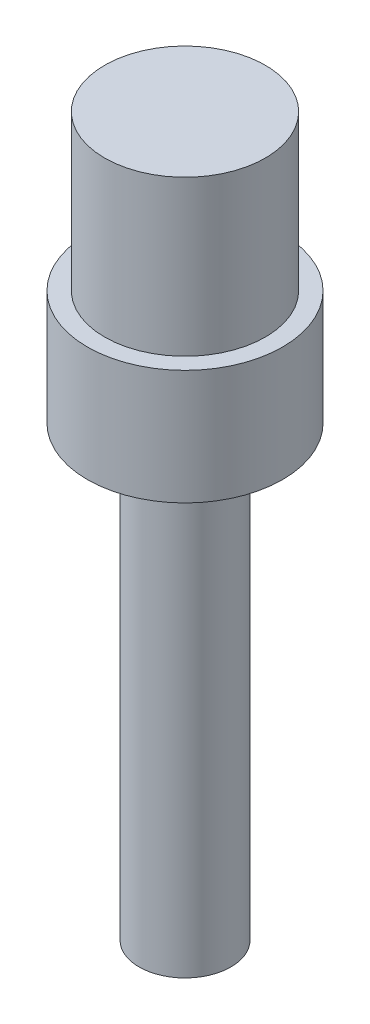
ISO-10303-21;
HEADER;
FILE_DESCRIPTION(('STEP AP214'),'2;1');
FILE_NAME('part.step','',(''),(''),'','','');
FILE_SCHEMA(('AUTOMOTIVE_DESIGN { 1 0 10303 214 1 1 1 1 }'));
ENDSEC;
DATA;
#1=APPLICATION_CONTEXT('core data for automotive mechanical design processes');
#2=APPLICATION_PROTOCOL_DEFINITION('international standard','automotive_design',2000,#1);
#3=PRODUCT_CONTEXT('',#1,'mechanical');
#4=PRODUCT('Part','Part','',(#3));
#5=PRODUCT_RELATED_PRODUCT_CATEGORY('part','',(#4));
#6=PRODUCT_DEFINITION_FORMATION('','',#4);
#7=PRODUCT_DEFINITION_CONTEXT('part definition',#1,'design');
#8=PRODUCT_DEFINITION('design','',#6,#7);
#9=PRODUCT_DEFINITION_SHAPE('','',#8);
#10=(LENGTH_UNIT() NAMED_UNIT(*) SI_UNIT(.MILLI.,.METRE.));
#11=(NAMED_UNIT(*) PLANE_ANGLE_UNIT() SI_UNIT($,.RADIAN.));
#12=(NAMED_UNIT(*) SI_UNIT($,.STERADIAN.) SOLID_ANGLE_UNIT());
#13=UNCERTAINTY_MEASURE_WITH_UNIT(LENGTH_MEASURE(1.E-05),#10,'distance_accuracy_value','');
#14=(GEOMETRIC_REPRESENTATION_CONTEXT(3) GLOBAL_UNCERTAINTY_ASSIGNED_CONTEXT((#13)) GLOBAL_UNIT_ASSIGNED_CONTEXT((#10,
#11,#12)) REPRESENTATION_CONTEXT('',''));
#15=CARTESIAN_POINT('',(0.,0.,0.));
#16=DIRECTION('',(0.,0.,1.));
#17=DIRECTION('',(1.,0.,0.));
#18=AXIS2_PLACEMENT_3D('',#15,#16,#17);
#19=CARTESIAN_POINT('',(0.,10.,0.));
#20=DIRECTION('',(0.,-1.,0.));
#21=DIRECTION('',(0.,0.,-1.));
#22=AXIS2_PLACEMENT_3D('',#19,#20,#21);
#23=CYLINDRICAL_SURFACE('',#22,8.5);
#24=CARTESIAN_POINT('',(0.,10.,0.));
#25=DIRECTION('',(0.,1.,0.));
#26=DIRECTION('',(0.,0.,1.));
#27=AXIS2_PLACEMENT_3D('',#24,#25,#26);
#28=CIRCLE('',#27,8.5);
#29=CARTESIAN_POINT('',(0.,10.,8.5));
#30=VERTEX_POINT('',#29);
#31=EDGE_CURVE('E42',#30,#30,#28,.T.);
#32=ORIENTED_EDGE('',*,*,#31,.F.);
#33=EDGE_LOOP('',(#32));
#34=FACE_BOUND('',#33,.T.);
#35=CARTESIAN_POINT('',(0.,0.,0.));
#36=DIRECTION('',(0.,1.,0.));
#37=DIRECTION('',(0.,0.,1.));
#38=AXIS2_PLACEMENT_3D('',#35,#36,#37);
#39=CIRCLE('',#38,8.5);
#40=CARTESIAN_POINT('',(0.,0.,8.5));
#41=VERTEX_POINT('',#40);
#42=EDGE_CURVE('E33',#41,#41,#39,.T.);
#43=ORIENTED_EDGE('',*,*,#42,.T.);
#44=EDGE_LOOP('',(#43));
#45=FACE_BOUND('',#44,.T.);
#46=ADVANCED_FACE('F30',(#34,#45),#23,.T.);
#47=CARTESIAN_POINT('',(0.,10.,0.));
#48=DIRECTION('',(0.,1.,0.));
#49=DIRECTION('',(0.,0.,1.));
#50=AXIS2_PLACEMENT_3D('',#47,#48,#49);
#51=PLANE('',#50);
#52=CARTESIAN_POINT('',(0.,10.,0.));
#53=DIRECTION('',(0.,1.,0.));
#54=DIRECTION('',(0.,0.,1.));
#55=AXIS2_PLACEMENT_3D('',#52,#53,#54);
#56=CIRCLE('',#55,7.);
#57=CARTESIAN_POINT('',(0.,10.,7.));
#58=VERTEX_POINT('',#57);
#59=EDGE_CURVE('E37',#58,#58,#56,.T.);
#60=ORIENTED_EDGE('',*,*,#59,.F.);
#61=EDGE_LOOP('',(#60));
#62=FACE_BOUND('',#61,.T.);
#63=ORIENTED_EDGE('',*,*,#31,.T.);
#64=EDGE_LOOP('',(#63));
#65=FACE_BOUND('',#64,.T.);
#66=ADVANCED_FACE('F59',(#62,#65),#51,.T.);
#67=CARTESIAN_POINT('',(0.,0.,0.));
#68=DIRECTION('',(0.,1.,0.));
#69=DIRECTION('',(0.,0.,1.));
#70=AXIS2_PLACEMENT_3D('',#67,#68,#69);
#71=PLANE('',#70);
#72=CARTESIAN_POINT('',(0.,0.,0.));
#73=DIRECTION('',(0.,-1.,0.));
#74=DIRECTION('',(0.,0.,-1.));
#75=AXIS2_PLACEMENT_3D('',#72,#73,#74);
#76=CIRCLE('',#75,4.);
#77=CARTESIAN_POINT('',(0.,0.,-4.));
#78=VERTEX_POINT('',#77);
#79=EDGE_CURVE('E10',#78,#78,#76,.T.);
#80=ORIENTED_EDGE('',*,*,#79,.F.);
#81=EDGE_LOOP('',(#80));
#82=FACE_BOUND('',#81,.T.);
#83=ORIENTED_EDGE('',*,*,#42,.F.);
#84=EDGE_LOOP('',(#83));
#85=FACE_BOUND('',#84,.T.);
#86=ADVANCED_FACE('F56',(#82,#85),#71,.F.);
#87=CARTESIAN_POINT('',(0.,23.5,0.));
#88=DIRECTION('',(0.,-1.,0.));
#89=DIRECTION('',(0.,0.,-1.));
#90=AXIS2_PLACEMENT_3D('',#87,#88,#89);
#91=CYLINDRICAL_SURFACE('',#90,7.);
#92=CARTESIAN_POINT('',(0.,23.5,0.));
#93=DIRECTION('',(0.,1.,0.));
#94=DIRECTION('',(0.,0.,1.));
#95=AXIS2_PLACEMENT_3D('',#92,#93,#94);
#96=CIRCLE('',#95,7.);
#97=CARTESIAN_POINT('',(0.,23.5,7.));
#98=VERTEX_POINT('',#97);
#99=EDGE_CURVE('E47',#98,#98,#96,.T.);
#100=ORIENTED_EDGE('',*,*,#99,.F.);
#101=EDGE_LOOP('',(#100));
#102=FACE_BOUND('',#101,.T.);
#103=ORIENTED_EDGE('',*,*,#59,.T.);
#104=EDGE_LOOP('',(#103));
#105=FACE_BOUND('',#104,.T.);
#106=ADVANCED_FACE('F58',(#102,#105),#91,.T.);
#107=CARTESIAN_POINT('',(0.,23.5,0.));
#108=DIRECTION('',(0.,1.,0.));
#109=DIRECTION('',(0.,0.,1.));
#110=AXIS2_PLACEMENT_3D('',#107,#108,#109);
#111=PLANE('',#110);
#112=ORIENTED_EDGE('',*,*,#99,.T.);
#113=EDGE_LOOP('',(#112));
#114=FACE_BOUND('',#113,.T.);
#115=ADVANCED_FACE('F65',(#114),#111,.T.);
#116=CARTESIAN_POINT('',(0.,-39.,0.));
#117=DIRECTION('',(0.,1.,0.));
#118=DIRECTION('',(0.,0.,1.));
#119=AXIS2_PLACEMENT_3D('',#116,#117,#118);
#120=CYLINDRICAL_SURFACE('',#119,4.);
#121=CARTESIAN_POINT('',(0.,-39.,0.));
#122=DIRECTION('',(0.,-1.,0.));
#123=DIRECTION('',(0.,0.,-1.));
#124=AXIS2_PLACEMENT_3D('',#121,#122,#123);
#125=CIRCLE('',#124,4.);
#126=CARTESIAN_POINT('',(0.,-39.,-4.));
#127=VERTEX_POINT('',#126);
#128=EDGE_CURVE('E46',#127,#127,#125,.T.);
#129=ORIENTED_EDGE('',*,*,#128,.F.);
#130=EDGE_LOOP('',(#129));
#131=FACE_BOUND('',#130,.T.);
#132=ORIENTED_EDGE('',*,*,#79,.T.);
#133=EDGE_LOOP('',(#132));
#134=FACE_BOUND('',#133,.T.);
#135=ADVANCED_FACE('F93',(#131,#134),#120,.T.);
#136=CARTESIAN_POINT('',(0.,-39.,0.));
#137=DIRECTION('',(0.,-1.,0.));
#138=DIRECTION('',(0.,0.,-1.));
#139=AXIS2_PLACEMENT_3D('',#136,#137,#138);
#140=PLANE('',#139);
#141=ORIENTED_EDGE('',*,*,#128,.T.);
#142=EDGE_LOOP('',(#141));
#143=FACE_BOUND('',#142,.T.);
#144=ADVANCED_FACE('F107',(#143),#140,.T.);
#145=CLOSED_SHELL('',(#46,#66,#86,#106,#115,#135,#144));
#146=MANIFOLD_SOLID_BREP('B2',#145);
#147=ADVANCED_BREP_SHAPE_REPRESENTATION('',(#18,#146),#14);
#148=SHAPE_DEFINITION_REPRESENTATION(#9,#147);
ENDSEC;
END-ISO-10303-21;
